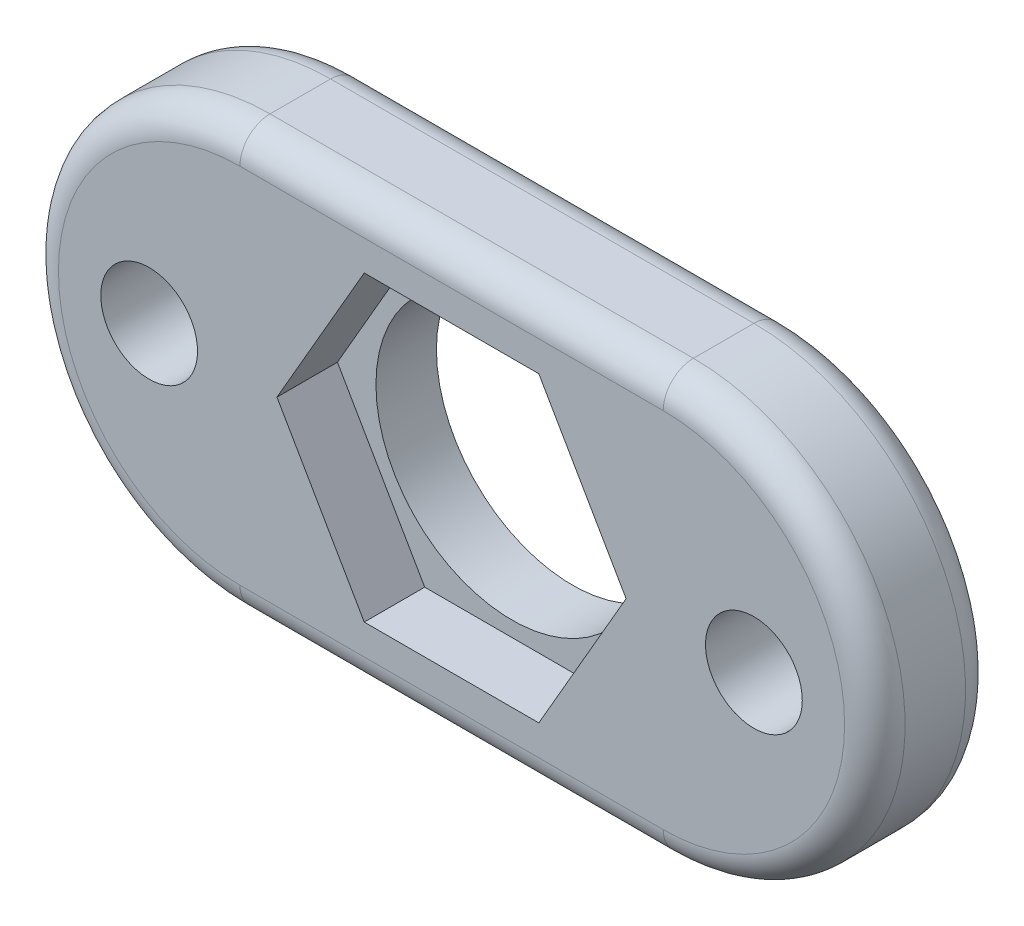
ISO-10303-21;
HEADER;
FILE_DESCRIPTION(('STEP AP214'),'2;1');
FILE_NAME('part.step','',(''),(''),'','','');
FILE_SCHEMA(('AUTOMOTIVE_DESIGN { 1 0 10303 214 1 1 1 1 }'));
ENDSEC;
DATA;
#1=APPLICATION_CONTEXT('core data for automotive mechanical design processes');
#2=APPLICATION_PROTOCOL_DEFINITION('international standard','automotive_design',2000,#1);
#3=PRODUCT_CONTEXT('',#1,'mechanical');
#4=PRODUCT('Part','Part','',(#3));
#5=PRODUCT_RELATED_PRODUCT_CATEGORY('part','',(#4));
#6=PRODUCT_DEFINITION_FORMATION('','',#4);
#7=PRODUCT_DEFINITION_CONTEXT('part definition',#1,'design');
#8=PRODUCT_DEFINITION('design','',#6,#7);
#9=PRODUCT_DEFINITION_SHAPE('','',#8);
#10=(LENGTH_UNIT() NAMED_UNIT(*) SI_UNIT(.MILLI.,.METRE.));
#11=(NAMED_UNIT(*) PLANE_ANGLE_UNIT() SI_UNIT($,.RADIAN.));
#12=(NAMED_UNIT(*) SI_UNIT($,.STERADIAN.) SOLID_ANGLE_UNIT());
#13=UNCERTAINTY_MEASURE_WITH_UNIT(LENGTH_MEASURE(1.E-05),#10,'distance_accuracy_value','');
#14=(GEOMETRIC_REPRESENTATION_CONTEXT(3) GLOBAL_UNCERTAINTY_ASSIGNED_CONTEXT((#13)) GLOBAL_UNIT_ASSIGNED_CONTEXT((#10,
#11,#12)) REPRESENTATION_CONTEXT('',''));
#15=CARTESIAN_POINT('',(0.,0.,0.));
#16=DIRECTION('',(0.,0.,1.));
#17=DIRECTION('',(1.,0.,0.));
#18=AXIS2_PLACEMENT_3D('',#15,#16,#17);
#19=CARTESIAN_POINT('',(-20.2541785109983,0.,0.));
#20=DIRECTION('',(0.,0.,1.));
#21=DIRECTION('',(1.,0.,0.));
#22=AXIS2_PLACEMENT_3D('',#19,#20,#21);
#23=CYLINDRICAL_SURFACE('',#22,4.5);
#24=CARTESIAN_POINT('',(-20.2541785109983,0.,0.));
#25=DIRECTION('',(0.,0.,1.));
#26=DIRECTION('',(1.,0.,0.));
#27=AXIS2_PLACEMENT_3D('',#24,#25,#26);
#28=CIRCLE('',#27,4.5);
#29=CARTESIAN_POINT('',(-15.7541785109983,0.,0.));
#30=VERTEX_POINT('',#29);
#31=EDGE_CURVE('E208',#30,#30,#28,.T.);
#32=ORIENTED_EDGE('',*,*,#31,.F.);
#33=EDGE_LOOP('',(#32));
#34=FACE_BOUND('',#33,.T.);
#35=CARTESIAN_POINT('',(-20.2541785109983,0.,2.));
#36=DIRECTION('',(0.,0.,1.));
#37=DIRECTION('',(1.,0.,0.));
#38=AXIS2_PLACEMENT_3D('',#35,#36,#37);
#39=CIRCLE('',#38,4.5);
#40=CARTESIAN_POINT('',(-15.7541785109983,0.,2.));
#41=VERTEX_POINT('',#40);
#42=EDGE_CURVE('E190',#41,#41,#39,.F.);
#43=ORIENTED_EDGE('',*,*,#42,.F.);
#44=EDGE_LOOP('',(#43));
#45=FACE_BOUND('',#44,.T.);
#46=ADVANCED_FACE('F33',(#34,#45),#23,.F.);
#47=CARTESIAN_POINT('',(-27.2541785109983,0.,4.));
#48=DIRECTION('',(0.,0.,-1.));
#49=DIRECTION('',(-1.,0.,0.));
#50=AXIS2_PLACEMENT_3D('',#47,#48,#49);
#51=CYLINDRICAL_SURFACE('',#50,7.);
#52=DIRECTION('',(0.,0.,-1.));
#53=VECTOR('',#52,1.);
#54=CARTESIAN_POINT('',(-27.2541785109983,-7.,4.));
#55=LINE('',#54,#53);
#56=CARTESIAN_POINT('',(-27.2541785109983,-7.,3.));
#57=VERTEX_POINT('',#56);
#58=CARTESIAN_POINT('',(-27.2541785109983,-7.,1.));
#59=VERTEX_POINT('',#58);
#60=EDGE_CURVE('E222',#57,#59,#55,.T.);
#61=ORIENTED_EDGE('',*,*,#60,.F.);
#62=CARTESIAN_POINT('',(-27.2541785109983,0.,3.));
#63=DIRECTION('',(0.,0.,1.));
#64=DIRECTION('',(1.,0.,0.));
#65=AXIS2_PLACEMENT_3D('',#62,#63,#64);
#66=CIRCLE('',#65,7.);
#67=CARTESIAN_POINT('',(-27.2541785109983,7.,3.));
#68=VERTEX_POINT('',#67);
#69=EDGE_CURVE('E11',#57,#68,#66,.F.);
#70=ORIENTED_EDGE('',*,*,#69,.T.);
#71=DIRECTION('',(0.,0.,-1.));
#72=VECTOR('',#71,1.);
#73=CARTESIAN_POINT('',(-27.2541785109983,7.,4.));
#74=LINE('',#73,#72);
#75=CARTESIAN_POINT('',(-27.2541785109983,7.,1.));
#76=VERTEX_POINT('',#75);
#77=EDGE_CURVE('E213',#68,#76,#74,.T.);
#78=ORIENTED_EDGE('',*,*,#77,.T.);
#79=CARTESIAN_POINT('',(-27.2541785109983,0.,1.));
#80=DIRECTION('',(0.,0.,1.));
#81=DIRECTION('',(1.,0.,0.));
#82=AXIS2_PLACEMENT_3D('',#79,#80,#81);
#83=CIRCLE('',#82,7.);
#84=EDGE_CURVE('E42',#76,#59,#83,.T.);
#85=ORIENTED_EDGE('',*,*,#84,.T.);
#86=EDGE_LOOP('',(#61,#70,#78,#85));
#87=FACE_BOUND('',#86,.T.);
#88=ADVANCED_FACE('F294',(#87),#51,.T.);
#89=CARTESIAN_POINT('',(-27.2541785109983,-7.,4.));
#90=DIRECTION('',(0.,1.,0.));
#91=DIRECTION('',(0.,0.,1.));
#92=AXIS2_PLACEMENT_3D('',#89,#90,#91);
#93=PLANE('',#92);
#94=DIRECTION('',(0.,0.,-1.));
#95=VECTOR('',#94,1.);
#96=CARTESIAN_POINT('',(-13.2541785109983,-7.,4.));
#97=LINE('',#96,#95);
#98=CARTESIAN_POINT('',(-13.2541785109983,-7.,3.));
#99=VERTEX_POINT('',#98);
#100=CARTESIAN_POINT('',(-13.2541785109983,-7.,1.));
#101=VERTEX_POINT('',#100);
#102=EDGE_CURVE('E219',#99,#101,#97,.T.);
#103=ORIENTED_EDGE('',*,*,#102,.F.);
#104=DIRECTION('',(1.,0.,0.));
#105=VECTOR('',#104,1.);
#106=CARTESIAN_POINT('',(-27.2541785109983,-7.,3.));
#107=LINE('',#106,#105);
#108=EDGE_CURVE('E248',#99,#57,#107,.F.);
#109=ORIENTED_EDGE('',*,*,#108,.T.);
#110=ORIENTED_EDGE('',*,*,#60,.T.);
#111=DIRECTION('',(1.,0.,0.));
#112=VECTOR('',#111,1.);
#113=CARTESIAN_POINT('',(-27.2541785109983,-7.,1.));
#114=LINE('',#113,#112);
#115=EDGE_CURVE('E246',#59,#101,#114,.T.);
#116=ORIENTED_EDGE('',*,*,#115,.T.);
#117=EDGE_LOOP('',(#103,#109,#110,#116));
#118=FACE_BOUND('',#117,.T.);
#119=ADVANCED_FACE('F311',(#118),#93,.F.);
#120=CARTESIAN_POINT('',(-13.2541785109983,0.,4.));
#121=DIRECTION('',(0.,0.,-1.));
#122=DIRECTION('',(-1.,0.,0.));
#123=AXIS2_PLACEMENT_3D('',#120,#121,#122);
#124=CYLINDRICAL_SURFACE('',#123,7.);
#125=DIRECTION('',(0.,0.,-1.));
#126=VECTOR('',#125,1.);
#127=CARTESIAN_POINT('',(-13.2541785109983,7.,4.));
#128=LINE('',#127,#126);
#129=CARTESIAN_POINT('',(-13.2541785109983,7.,3.));
#130=VERTEX_POINT('',#129);
#131=CARTESIAN_POINT('',(-13.2541785109983,7.,1.));
#132=VERTEX_POINT('',#131);
#133=EDGE_CURVE('E216',#130,#132,#128,.T.);
#134=ORIENTED_EDGE('',*,*,#133,.F.);
#135=CARTESIAN_POINT('',(-13.2541785109983,0.,3.));
#136=DIRECTION('',(0.,0.,1.));
#137=DIRECTION('',(1.,0.,0.));
#138=AXIS2_PLACEMENT_3D('',#135,#136,#137);
#139=CIRCLE('',#138,7.);
#140=EDGE_CURVE('E244',#130,#99,#139,.F.);
#141=ORIENTED_EDGE('',*,*,#140,.T.);
#142=ORIENTED_EDGE('',*,*,#102,.T.);
#143=CARTESIAN_POINT('',(-13.2541785109983,0.,1.));
#144=DIRECTION('',(0.,0.,1.));
#145=DIRECTION('',(1.,0.,0.));
#146=AXIS2_PLACEMENT_3D('',#143,#144,#145);
#147=CIRCLE('',#146,7.);
#148=EDGE_CURVE('E242',#101,#132,#147,.T.);
#149=ORIENTED_EDGE('',*,*,#148,.T.);
#150=EDGE_LOOP('',(#134,#141,#142,#149));
#151=FACE_BOUND('',#150,.T.);
#152=ADVANCED_FACE('F307',(#151),#124,.T.);
#153=CARTESIAN_POINT('',(-27.2541785109983,7.,4.));
#154=DIRECTION('',(0.,-1.,0.));
#155=DIRECTION('',(0.,0.,-1.));
#156=AXIS2_PLACEMENT_3D('',#153,#154,#155);
#157=PLANE('',#156);
#158=ORIENTED_EDGE('',*,*,#77,.F.);
#159=DIRECTION('',(-1.,0.,0.));
#160=VECTOR('',#159,1.);
#161=CARTESIAN_POINT('',(-13.2541785109983,7.,3.));
#162=LINE('',#161,#160);
#163=EDGE_CURVE('E239',#68,#130,#162,.F.);
#164=ORIENTED_EDGE('',*,*,#163,.T.);
#165=ORIENTED_EDGE('',*,*,#133,.T.);
#166=DIRECTION('',(-1.,0.,0.));
#167=VECTOR('',#166,1.);
#168=CARTESIAN_POINT('',(-27.2541785109983,7.,1.));
#169=LINE('',#168,#167);
#170=EDGE_CURVE('E236',#132,#76,#169,.T.);
#171=ORIENTED_EDGE('',*,*,#170,.T.);
#172=EDGE_LOOP('',(#158,#164,#165,#171));
#173=FACE_BOUND('',#172,.T.);
#174=ADVANCED_FACE('F291',(#173),#157,.F.);
#175=CARTESIAN_POINT('',(-27.2541785109983,0.,4.));
#176=DIRECTION('',(0.,0.,1.));
#177=DIRECTION('',(1.,0.,0.));
#178=AXIS2_PLACEMENT_3D('',#175,#176,#177);
#179=PLANE('',#178);
#180=CARTESIAN_POINT('',(-13.2541785109983,0.,4.));
#181=DIRECTION('',(0.,0.,1.));
#182=DIRECTION('',(1.,0.,0.));
#183=AXIS2_PLACEMENT_3D('',#180,#181,#182);
#184=CIRCLE('',#183,6.);
#185=CARTESIAN_POINT('',(-13.2541785109983,-6.,4.));
#186=VERTEX_POINT('',#185);
#187=CARTESIAN_POINT('',(-13.2541785109983,6.,4.));
#188=VERTEX_POINT('',#187);
#189=EDGE_CURVE('E231',#186,#188,#184,.T.);
#190=ORIENTED_EDGE('',*,*,#189,.T.);
#191=DIRECTION('',(-1.,0.,0.));
#192=VECTOR('',#191,1.);
#193=CARTESIAN_POINT('',(-27.2541785109983,6.,4.));
#194=LINE('',#193,#192);
#195=CARTESIAN_POINT('',(-27.2541785109983,6.,4.));
#196=VERTEX_POINT('',#195);
#197=EDGE_CURVE('E233',#188,#196,#194,.T.);
#198=ORIENTED_EDGE('',*,*,#197,.T.);
#199=CARTESIAN_POINT('',(-27.2541785109983,0.,4.));
#200=DIRECTION('',(0.,0.,1.));
#201=DIRECTION('',(1.,0.,0.));
#202=AXIS2_PLACEMENT_3D('',#199,#200,#201);
#203=CIRCLE('',#202,6.);
#204=CARTESIAN_POINT('',(-27.2541785109983,-6.,4.));
#205=VERTEX_POINT('',#204);
#206=EDGE_CURVE('E225',#196,#205,#203,.T.);
#207=ORIENTED_EDGE('',*,*,#206,.T.);
#208=DIRECTION('',(1.,0.,0.));
#209=VECTOR('',#208,1.);
#210=CARTESIAN_POINT('',(-13.2541785109983,-6.,4.));
#211=LINE('',#210,#209);
#212=EDGE_CURVE('E229',#205,#186,#211,.T.);
#213=ORIENTED_EDGE('',*,*,#212,.T.);
#214=EDGE_LOOP('',(#190,#198,#207,#213));
#215=FACE_BOUND('',#214,.T.);
#216=DIRECTION('',(-1.,0.,0.));
#217=VECTOR('',#216,1.);
#218=CARTESIAN_POINT('',(-17.3674271650502,5.,4.));
#219=LINE('',#218,#217);
#220=CARTESIAN_POINT('',(-17.3674271650502,5.,4.));
#221=VERTEX_POINT('',#220);
#222=CARTESIAN_POINT('',(-23.1409298569464,5.,4.));
#223=VERTEX_POINT('',#222);
#224=EDGE_CURVE('E144',#221,#223,#219,.T.);
#225=ORIENTED_EDGE('',*,*,#224,.F.);
#226=DIRECTION('',(-0.5,0.866025403784439,0.));
#227=VECTOR('',#226,1.);
#228=CARTESIAN_POINT('',(-14.4806758191021,0.,4.));
#229=LINE('',#228,#227);
#230=CARTESIAN_POINT('',(-14.4806758191021,0.,4.));
#231=VERTEX_POINT('',#230);
#232=EDGE_CURVE('E163',#231,#221,#229,.T.);
#233=ORIENTED_EDGE('',*,*,#232,.F.);
#234=DIRECTION('',(0.5,0.866025403784438,0.));
#235=VECTOR('',#234,1.);
#236=CARTESIAN_POINT('',(-17.3674271650502,-4.99999999999999,4.));
#237=LINE('',#236,#235);
#238=CARTESIAN_POINT('',(-17.3674271650502,-4.99999999999999,4.));
#239=VERTEX_POINT('',#238);
#240=EDGE_CURVE('E166',#239,#231,#237,.T.);
#241=ORIENTED_EDGE('',*,*,#240,.F.);
#242=DIRECTION('',(1.,0.,0.));
#243=VECTOR('',#242,1.);
#244=CARTESIAN_POINT('',(-23.1409298569464,-5.,4.));
#245=LINE('',#244,#243);
#246=CARTESIAN_POINT('',(-23.1409298569464,-5.,4.));
#247=VERTEX_POINT('',#246);
#248=EDGE_CURVE('E183',#247,#239,#245,.T.);
#249=ORIENTED_EDGE('',*,*,#248,.F.);
#250=DIRECTION('',(0.500000000000001,-0.866025403784438,0.));
#251=VECTOR('',#250,1.);
#252=CARTESIAN_POINT('',(-26.0276812028946,0.,4.));
#253=LINE('',#252,#251);
#254=CARTESIAN_POINT('',(-26.0276812028946,0.,4.));
#255=VERTEX_POINT('',#254);
#256=EDGE_CURVE('E180',#255,#247,#253,.T.);
#257=ORIENTED_EDGE('',*,*,#256,.F.);
#258=DIRECTION('',(-0.5,-0.866025403784438,0.));
#259=VECTOR('',#258,1.);
#260=CARTESIAN_POINT('',(-23.1409298569464,5.,4.));
#261=LINE('',#260,#259);
#262=EDGE_CURVE('E177',#223,#255,#261,.T.);
#263=ORIENTED_EDGE('',*,*,#262,.F.);
#264=EDGE_LOOP('',(#225,#233,#241,#249,#257,#263));
#265=FACE_BOUND('',#264,.T.);
#266=CARTESIAN_POINT('',(-10.2541785109983,0.,4.));
#267=DIRECTION('',(0.,0.,1.));
#268=DIRECTION('',(1.,0.,0.));
#269=AXIS2_PLACEMENT_3D('',#266,#267,#268);
#270=CIRCLE('',#269,1.6);
#271=CARTESIAN_POINT('',(-8.65417851099832,0.,4.));
#272=VERTEX_POINT('',#271);
#273=EDGE_CURVE('E202',#272,#272,#270,.T.);
#274=ORIENTED_EDGE('',*,*,#273,.F.);
#275=EDGE_LOOP('',(#274));
#276=FACE_BOUND('',#275,.T.);
#277=CARTESIAN_POINT('',(-30.2541785109983,0.,4.));
#278=DIRECTION('',(0.,0.,1.));
#279=DIRECTION('',(1.,0.,0.));
#280=AXIS2_PLACEMENT_3D('',#277,#278,#279);
#281=CIRCLE('',#280,1.60000000000001);
#282=CARTESIAN_POINT('',(-28.6541785109983,0.,4.));
#283=VERTEX_POINT('',#282);
#284=EDGE_CURVE('E201',#283,#283,#281,.T.);
#285=ORIENTED_EDGE('',*,*,#284,.F.);
#286=EDGE_LOOP('',(#285));
#287=FACE_BOUND('',#286,.T.);
#288=ADVANCED_FACE('F320',(#215,#265,#276,#287),#179,.T.);
#289=CARTESIAN_POINT('',(-27.2541785109983,0.,0.));
#290=DIRECTION('',(0.,0.,1.));
#291=DIRECTION('',(1.,0.,0.));
#292=AXIS2_PLACEMENT_3D('',#289,#290,#291);
#293=PLANE('',#292);
#294=CARTESIAN_POINT('',(-27.2541785109983,0.,0.));
#295=DIRECTION('',(0.,0.,1.));
#296=DIRECTION('',(1.,0.,0.));
#297=AXIS2_PLACEMENT_3D('',#294,#295,#296);
#298=CIRCLE('',#297,6.);
#299=CARTESIAN_POINT('',(-27.2541785109983,-6.,0.));
#300=VERTEX_POINT('',#299);
#301=CARTESIAN_POINT('',(-27.2541785109983,6.,0.));
#302=VERTEX_POINT('',#301);
#303=EDGE_CURVE('E250',#300,#302,#298,.F.);
#304=ORIENTED_EDGE('',*,*,#303,.T.);
#305=DIRECTION('',(-1.,0.,0.));
#306=VECTOR('',#305,1.);
#307=CARTESIAN_POINT('',(-27.2541785109983,6.,0.));
#308=LINE('',#307,#306);
#309=CARTESIAN_POINT('',(-13.2541785109983,6.,0.));
#310=VERTEX_POINT('',#309);
#311=EDGE_CURVE('E255',#302,#310,#308,.F.);
#312=ORIENTED_EDGE('',*,*,#311,.T.);
#313=CARTESIAN_POINT('',(-13.2541785109983,0.,0.));
#314=DIRECTION('',(0.,0.,1.));
#315=DIRECTION('',(1.,0.,0.));
#316=AXIS2_PLACEMENT_3D('',#313,#314,#315);
#317=CIRCLE('',#316,6.);
#318=CARTESIAN_POINT('',(-13.2541785109983,-6.,0.));
#319=VERTEX_POINT('',#318);
#320=EDGE_CURVE('E57',#310,#319,#317,.F.);
#321=ORIENTED_EDGE('',*,*,#320,.T.);
#322=DIRECTION('',(1.,0.,0.));
#323=VECTOR('',#322,1.);
#324=CARTESIAN_POINT('',(-27.2541785109983,-6.,0.));
#325=LINE('',#324,#323);
#326=EDGE_CURVE('E252',#319,#300,#325,.F.);
#327=ORIENTED_EDGE('',*,*,#326,.T.);
#328=EDGE_LOOP('',(#304,#312,#321,#327));
#329=FACE_BOUND('',#328,.T.);
#330=CARTESIAN_POINT('',(-10.2541785109983,0.,0.));
#331=DIRECTION('',(0.,0.,1.));
#332=DIRECTION('',(1.,0.,0.));
#333=AXIS2_PLACEMENT_3D('',#330,#331,#332);
#334=CIRCLE('',#333,1.6);
#335=CARTESIAN_POINT('',(-8.65417851099832,0.,0.));
#336=VERTEX_POINT('',#335);
#337=EDGE_CURVE('E198',#336,#336,#334,.T.);
#338=ORIENTED_EDGE('',*,*,#337,.T.);
#339=EDGE_LOOP('',(#338));
#340=FACE_BOUND('',#339,.T.);
#341=CARTESIAN_POINT('',(-30.2541785109983,0.,0.));
#342=DIRECTION('',(0.,0.,1.));
#343=DIRECTION('',(1.,0.,0.));
#344=AXIS2_PLACEMENT_3D('',#341,#342,#343);
#345=CIRCLE('',#344,1.60000000000001);
#346=CARTESIAN_POINT('',(-28.6541785109983,0.,0.));
#347=VERTEX_POINT('',#346);
#348=EDGE_CURVE('E205',#347,#347,#345,.T.);
#349=ORIENTED_EDGE('',*,*,#348,.T.);
#350=EDGE_LOOP('',(#349));
#351=FACE_BOUND('',#350,.T.);
#352=ORIENTED_EDGE('',*,*,#31,.T.);
#353=EDGE_LOOP('',(#352));
#354=FACE_BOUND('',#353,.T.);
#355=ADVANCED_FACE('F282',(#329,#340,#351,#354),#293,.F.);
#356=CARTESIAN_POINT('',(-30.2541785109983,0.,0.));
#357=DIRECTION('',(0.,0.,1.));
#358=DIRECTION('',(1.,0.,0.));
#359=AXIS2_PLACEMENT_3D('',#356,#357,#358);
#360=CYLINDRICAL_SURFACE('',#359,1.60000000000001);
#361=ORIENTED_EDGE('',*,*,#348,.F.);
#362=EDGE_LOOP('',(#361));
#363=FACE_BOUND('',#362,.T.);
#364=ORIENTED_EDGE('',*,*,#284,.T.);
#365=EDGE_LOOP('',(#364));
#366=FACE_BOUND('',#365,.T.);
#367=ADVANCED_FACE('F330',(#363,#366),#360,.F.);
#368=CARTESIAN_POINT('',(-10.2541785109983,0.,0.));
#369=DIRECTION('',(0.,0.,1.));
#370=DIRECTION('',(1.,0.,0.));
#371=AXIS2_PLACEMENT_3D('',#368,#369,#370);
#372=CYLINDRICAL_SURFACE('',#371,1.6);
#373=ORIENTED_EDGE('',*,*,#337,.F.);
#374=EDGE_LOOP('',(#373));
#375=FACE_BOUND('',#374,.T.);
#376=ORIENTED_EDGE('',*,*,#273,.T.);
#377=EDGE_LOOP('',(#376));
#378=FACE_BOUND('',#377,.T.);
#379=ADVANCED_FACE('F332',(#375,#378),#372,.F.);
#380=CARTESIAN_POINT('',(0.,0.,2.));
#381=DIRECTION('',(0.,0.,1.));
#382=DIRECTION('',(1.,0.,0.));
#383=AXIS2_PLACEMENT_3D('',#380,#381,#382);
#384=PLANE('',#383);
#385=DIRECTION('',(-1.,0.,0.));
#386=VECTOR('',#385,1.);
#387=CARTESIAN_POINT('',(-17.3674271650502,5.,2.));
#388=LINE('',#387,#386);
#389=CARTESIAN_POINT('',(-17.3674271650502,5.,2.));
#390=VERTEX_POINT('',#389);
#391=CARTESIAN_POINT('',(-23.1409298569464,5.,2.));
#392=VERTEX_POINT('',#391);
#393=EDGE_CURVE('E141',#390,#392,#388,.T.);
#394=ORIENTED_EDGE('',*,*,#393,.T.);
#395=DIRECTION('',(-0.5,-0.866025403784438,0.));
#396=VECTOR('',#395,1.);
#397=CARTESIAN_POINT('',(-23.1409298569464,5.,2.));
#398=LINE('',#397,#396);
#399=CARTESIAN_POINT('',(-26.0276812028946,0.,2.));
#400=VERTEX_POINT('',#399);
#401=EDGE_CURVE('E152',#392,#400,#398,.T.);
#402=ORIENTED_EDGE('',*,*,#401,.T.);
#403=DIRECTION('',(0.500000000000001,-0.866025403784438,0.));
#404=VECTOR('',#403,1.);
#405=CARTESIAN_POINT('',(-26.0276812028946,0.,2.));
#406=LINE('',#405,#404);
#407=CARTESIAN_POINT('',(-23.1409298569464,-5.,2.));
#408=VERTEX_POINT('',#407);
#409=EDGE_CURVE('E157',#400,#408,#406,.T.);
#410=ORIENTED_EDGE('',*,*,#409,.T.);
#411=DIRECTION('',(1.,0.,0.));
#412=VECTOR('',#411,1.);
#413=CARTESIAN_POINT('',(-23.1409298569464,-5.,2.));
#414=LINE('',#413,#412);
#415=CARTESIAN_POINT('',(-17.3674271650502,-4.99999999999999,2.));
#416=VERTEX_POINT('',#415);
#417=EDGE_CURVE('E170',#408,#416,#414,.T.);
#418=ORIENTED_EDGE('',*,*,#417,.T.);
#419=DIRECTION('',(0.5,0.866025403784438,0.));
#420=VECTOR('',#419,1.);
#421=CARTESIAN_POINT('',(-17.3674271650502,-4.99999999999999,2.));
#422=LINE('',#421,#420);
#423=CARTESIAN_POINT('',(-14.4806758191021,0.,2.));
#424=VERTEX_POINT('',#423);
#425=EDGE_CURVE('E173',#416,#424,#422,.T.);
#426=ORIENTED_EDGE('',*,*,#425,.T.);
#427=DIRECTION('',(-0.5,0.866025403784439,0.));
#428=VECTOR('',#427,1.);
#429=CARTESIAN_POINT('',(-14.4806758191021,0.,2.));
#430=LINE('',#429,#428);
#431=EDGE_CURVE('E149',#424,#390,#430,.T.);
#432=ORIENTED_EDGE('',*,*,#431,.T.);
#433=EDGE_LOOP('',(#394,#402,#410,#418,#426,#432));
#434=FACE_BOUND('',#433,.T.);
#435=ORIENTED_EDGE('',*,*,#42,.T.);
#436=EDGE_LOOP('',(#435));
#437=FACE_BOUND('',#436,.T.);
#438=ADVANCED_FACE('F159',(#434,#437),#384,.T.);
#439=CARTESIAN_POINT('',(-17.3674271650502,5.,2.));
#440=DIRECTION('',(0.,1.,0.));
#441=DIRECTION('',(-1.,0.,0.));
#442=AXIS2_PLACEMENT_3D('',#439,#440,#441);
#443=PLANE('',#442);
#444=ORIENTED_EDGE('',*,*,#224,.T.);
#445=DIRECTION('',(0.,0.,1.));
#446=VECTOR('',#445,1.);
#447=CARTESIAN_POINT('',(-23.1409298569464,5.,2.));
#448=LINE('',#447,#446);
#449=EDGE_CURVE('E137',#392,#223,#448,.T.);
#450=ORIENTED_EDGE('',*,*,#449,.F.);
#451=ORIENTED_EDGE('',*,*,#393,.F.);
#452=DIRECTION('',(0.,0.,1.));
#453=VECTOR('',#452,1.);
#454=CARTESIAN_POINT('',(-17.3674271650502,5.,2.));
#455=LINE('',#454,#453);
#456=EDGE_CURVE('E188',#390,#221,#455,.T.);
#457=ORIENTED_EDGE('',*,*,#456,.T.);
#458=EDGE_LOOP('',(#444,#450,#451,#457));
#459=FACE_BOUND('',#458,.T.);
#460=ADVANCED_FACE('F139',(#459),#443,.F.);
#461=CARTESIAN_POINT('',(-14.4806758191021,0.,2.));
#462=DIRECTION('',(0.866025403784439,0.5,0.));
#463=DIRECTION('',(-0.5,0.866025403784439,0.));
#464=AXIS2_PLACEMENT_3D('',#461,#462,#463);
#465=PLANE('',#464);
#466=ORIENTED_EDGE('',*,*,#232,.T.);
#467=ORIENTED_EDGE('',*,*,#456,.F.);
#468=ORIENTED_EDGE('',*,*,#431,.F.);
#469=DIRECTION('',(0.,0.,1.));
#470=VECTOR('',#469,1.);
#471=CARTESIAN_POINT('',(-14.4806758191021,0.,2.));
#472=LINE('',#471,#470);
#473=EDGE_CURVE('E191',#424,#231,#472,.T.);
#474=ORIENTED_EDGE('',*,*,#473,.T.);
#475=EDGE_LOOP('',(#466,#467,#468,#474));
#476=FACE_BOUND('',#475,.T.);
#477=ADVANCED_FACE('F423',(#476),#465,.F.);
#478=CARTESIAN_POINT('',(-17.3674271650502,-4.99999999999999,2.));
#479=DIRECTION('',(0.866025403784438,-0.5,0.));
#480=DIRECTION('',(0.5,0.866025403784438,0.));
#481=AXIS2_PLACEMENT_3D('',#478,#479,#480);
#482=PLANE('',#481);
#483=ORIENTED_EDGE('',*,*,#240,.T.);
#484=ORIENTED_EDGE('',*,*,#473,.F.);
#485=ORIENTED_EDGE('',*,*,#425,.F.);
#486=DIRECTION('',(0.,0.,1.));
#487=VECTOR('',#486,1.);
#488=CARTESIAN_POINT('',(-17.3674271650502,-4.99999999999999,2.));
#489=LINE('',#488,#487);
#490=EDGE_CURVE('E193',#416,#239,#489,.T.);
#491=ORIENTED_EDGE('',*,*,#490,.T.);
#492=EDGE_LOOP('',(#483,#484,#485,#491));
#493=FACE_BOUND('',#492,.T.);
#494=ADVANCED_FACE('F415',(#493),#482,.F.);
#495=CARTESIAN_POINT('',(-23.1409298569464,-5.,2.));
#496=DIRECTION('',(0.,-1.,0.));
#497=DIRECTION('',(1.,0.,0.));
#498=AXIS2_PLACEMENT_3D('',#495,#496,#497);
#499=PLANE('',#498);
#500=ORIENTED_EDGE('',*,*,#248,.T.);
#501=ORIENTED_EDGE('',*,*,#490,.F.);
#502=ORIENTED_EDGE('',*,*,#417,.F.);
#503=DIRECTION('',(0.,0.,1.));
#504=VECTOR('',#503,1.);
#505=CARTESIAN_POINT('',(-23.1409298569464,-5.,2.));
#506=LINE('',#505,#504);
#507=EDGE_CURVE('E195',#408,#247,#506,.T.);
#508=ORIENTED_EDGE('',*,*,#507,.T.);
#509=EDGE_LOOP('',(#500,#501,#502,#508));
#510=FACE_BOUND('',#509,.T.);
#511=ADVANCED_FACE('F407',(#510),#499,.F.);
#512=CARTESIAN_POINT('',(-26.0276812028946,0.,2.));
#513=DIRECTION('',(-0.866025403784438,-0.500000000000001,0.));
#514=DIRECTION('',(0.500000000000001,-0.866025403784438,0.));
#515=AXIS2_PLACEMENT_3D('',#512,#513,#514);
#516=PLANE('',#515);
#517=ORIENTED_EDGE('',*,*,#256,.T.);
#518=ORIENTED_EDGE('',*,*,#507,.F.);
#519=ORIENTED_EDGE('',*,*,#409,.F.);
#520=DIRECTION('',(0.,0.,1.));
#521=VECTOR('',#520,1.);
#522=CARTESIAN_POINT('',(-26.0276812028946,0.,2.));
#523=LINE('',#522,#521);
#524=EDGE_CURVE('E148',#400,#255,#523,.T.);
#525=ORIENTED_EDGE('',*,*,#524,.T.);
#526=EDGE_LOOP('',(#517,#518,#519,#525));
#527=FACE_BOUND('',#526,.T.);
#528=ADVANCED_FACE('F399',(#527),#516,.F.);
#529=CARTESIAN_POINT('',(-23.1409298569464,5.,2.));
#530=DIRECTION('',(-0.866025403784438,0.5,0.));
#531=DIRECTION('',(-0.5,-0.866025403784439,0.));
#532=AXIS2_PLACEMENT_3D('',#529,#530,#531);
#533=PLANE('',#532);
#534=ORIENTED_EDGE('',*,*,#262,.T.);
#535=ORIENTED_EDGE('',*,*,#524,.F.);
#536=ORIENTED_EDGE('',*,*,#401,.F.);
#537=ORIENTED_EDGE('',*,*,#449,.T.);
#538=EDGE_LOOP('',(#534,#535,#536,#537));
#539=FACE_BOUND('',#538,.T.);
#540=ADVANCED_FACE('F153',(#539),#533,.F.);
#541=CARTESIAN_POINT('',(-27.2541785109983,-6.,3.));
#542=DIRECTION('',(-1.,0.,0.));
#543=DIRECTION('',(0.,0.,1.));
#544=AXIS2_PLACEMENT_3D('',#541,#542,#543);
#545=CYLINDRICAL_SURFACE('',#544,1.);
#546=CARTESIAN_POINT('',(-27.2541785109983,-6.,3.));
#547=DIRECTION('',(-1.,0.,0.));
#548=DIRECTION('',(0.,0.,1.));
#549=AXIS2_PLACEMENT_3D('',#546,#547,#548);
#550=CIRCLE('',#549,1.);
#551=EDGE_CURVE('E262',#57,#205,#550,.T.);
#552=ORIENTED_EDGE('',*,*,#551,.F.);
#553=ORIENTED_EDGE('',*,*,#108,.F.);
#554=CARTESIAN_POINT('',(-13.2541785109983,-6.,3.));
#555=DIRECTION('',(1.,0.,0.));
#556=DIRECTION('',(0.,0.,-1.));
#557=AXIS2_PLACEMENT_3D('',#554,#555,#556);
#558=CIRCLE('',#557,1.);
#559=EDGE_CURVE('E178',#186,#99,#558,.T.);
#560=ORIENTED_EDGE('',*,*,#559,.F.);
#561=ORIENTED_EDGE('',*,*,#212,.F.);
#562=EDGE_LOOP('',(#552,#553,#560,#561));
#563=FACE_BOUND('',#562,.T.);
#564=ADVANCED_FACE('F314',(#563),#545,.T.);
#565=CARTESIAN_POINT('',(-13.2541785109983,0.,3.));
#566=DIRECTION('',(0.,0.,1.));
#567=DIRECTION('',(1.,0.,0.));
#568=AXIS2_PLACEMENT_3D('',#565,#566,#567);
#569=TOROIDAL_SURFACE('',#568,6.,1.);
#570=ORIENTED_EDGE('',*,*,#559,.T.);
#571=ORIENTED_EDGE('',*,*,#140,.F.);
#572=CARTESIAN_POINT('',(-13.2541785109983,6.,3.));
#573=DIRECTION('',(-1.,0.,0.));
#574=DIRECTION('',(0.,0.,1.));
#575=AXIS2_PLACEMENT_3D('',#572,#573,#574);
#576=CIRCLE('',#575,1.);
#577=EDGE_CURVE('E260',#188,#130,#576,.T.);
#578=ORIENTED_EDGE('',*,*,#577,.F.);
#579=ORIENTED_EDGE('',*,*,#189,.F.);
#580=EDGE_LOOP('',(#570,#571,#578,#579));
#581=FACE_BOUND('',#580,.T.);
#582=ADVANCED_FACE('F318',(#581),#569,.T.);
#583=CARTESIAN_POINT('',(-27.2541785109983,0.,3.));
#584=DIRECTION('',(0.,0.,1.));
#585=DIRECTION('',(1.,0.,0.));
#586=AXIS2_PLACEMENT_3D('',#583,#584,#585);
#587=TOROIDAL_SURFACE('',#586,6.,1.);
#588=ORIENTED_EDGE('',*,*,#551,.T.);
#589=ORIENTED_EDGE('',*,*,#206,.F.);
#590=CARTESIAN_POINT('',(-27.2541785109983,6.,3.));
#591=DIRECTION('',(1.,0.,0.));
#592=DIRECTION('',(0.,0.,-1.));
#593=AXIS2_PLACEMENT_3D('',#590,#591,#592);
#594=CIRCLE('',#593,1.);
#595=EDGE_CURVE('E258',#68,#196,#594,.T.);
#596=ORIENTED_EDGE('',*,*,#595,.F.);
#597=ORIENTED_EDGE('',*,*,#69,.F.);
#598=EDGE_LOOP('',(#588,#589,#596,#597));
#599=FACE_BOUND('',#598,.T.);
#600=ADVANCED_FACE('F299',(#599),#587,.T.);
#601=CARTESIAN_POINT('',(-27.2541785109983,6.,3.));
#602=DIRECTION('',(1.,0.,0.));
#603=DIRECTION('',(0.,0.,-1.));
#604=AXIS2_PLACEMENT_3D('',#601,#602,#603);
#605=CYLINDRICAL_SURFACE('',#604,1.);
#606=ORIENTED_EDGE('',*,*,#577,.T.);
#607=ORIENTED_EDGE('',*,*,#163,.F.);
#608=ORIENTED_EDGE('',*,*,#595,.T.);
#609=ORIENTED_EDGE('',*,*,#197,.F.);
#610=EDGE_LOOP('',(#606,#607,#608,#609));
#611=FACE_BOUND('',#610,.T.);
#612=ADVANCED_FACE('F303',(#611),#605,.T.);
#613=CARTESIAN_POINT('',(-27.2541785109983,-6.,1.));
#614=DIRECTION('',(1.,0.,0.));
#615=DIRECTION('',(0.,0.,-1.));
#616=AXIS2_PLACEMENT_3D('',#613,#614,#615);
#617=CYLINDRICAL_SURFACE('',#616,1.);
#618=CARTESIAN_POINT('',(-27.2541785109983,-6.,1.));
#619=DIRECTION('',(-1.,0.,0.));
#620=DIRECTION('',(0.,0.,1.));
#621=AXIS2_PLACEMENT_3D('',#618,#619,#620);
#622=CIRCLE('',#621,1.);
#623=EDGE_CURVE('E269',#300,#59,#622,.T.);
#624=ORIENTED_EDGE('',*,*,#623,.F.);
#625=ORIENTED_EDGE('',*,*,#326,.F.);
#626=CARTESIAN_POINT('',(-13.2541785109983,-6.,1.));
#627=DIRECTION('',(1.,0.,0.));
#628=DIRECTION('',(0.,0.,-1.));
#629=AXIS2_PLACEMENT_3D('',#626,#627,#628);
#630=CIRCLE('',#629,1.);
#631=EDGE_CURVE('E37',#101,#319,#630,.T.);
#632=ORIENTED_EDGE('',*,*,#631,.F.);
#633=ORIENTED_EDGE('',*,*,#115,.F.);
#634=EDGE_LOOP('',(#624,#625,#632,#633));
#635=FACE_BOUND('',#634,.T.);
#636=ADVANCED_FACE('F35',(#635),#617,.T.);
#637=CARTESIAN_POINT('',(-13.2541785109983,0.,1.));
#638=DIRECTION('',(0.,0.,1.));
#639=DIRECTION('',(1.,0.,0.));
#640=AXIS2_PLACEMENT_3D('',#637,#638,#639);
#641=TOROIDAL_SURFACE('',#640,6.,1.);
#642=ORIENTED_EDGE('',*,*,#631,.T.);
#643=ORIENTED_EDGE('',*,*,#320,.F.);
#644=CARTESIAN_POINT('',(-13.2541785109983,6.,1.));
#645=DIRECTION('',(-1.,0.,0.));
#646=DIRECTION('',(0.,0.,1.));
#647=AXIS2_PLACEMENT_3D('',#644,#645,#646);
#648=CIRCLE('',#647,1.);
#649=EDGE_CURVE('E50',#132,#310,#648,.T.);
#650=ORIENTED_EDGE('',*,*,#649,.F.);
#651=ORIENTED_EDGE('',*,*,#148,.F.);
#652=EDGE_LOOP('',(#642,#643,#650,#651));
#653=FACE_BOUND('',#652,.T.);
#654=ADVANCED_FACE('F279',(#653),#641,.T.);
#655=CARTESIAN_POINT('',(-27.2541785109983,0.,1.));
#656=DIRECTION('',(0.,0.,1.));
#657=DIRECTION('',(1.,0.,0.));
#658=AXIS2_PLACEMENT_3D('',#655,#656,#657);
#659=TOROIDAL_SURFACE('',#658,6.,1.);
#660=ORIENTED_EDGE('',*,*,#623,.T.);
#661=ORIENTED_EDGE('',*,*,#84,.F.);
#662=CARTESIAN_POINT('',(-27.2541785109983,6.,1.));
#663=DIRECTION('',(1.,0.,0.));
#664=DIRECTION('',(0.,0.,-1.));
#665=AXIS2_PLACEMENT_3D('',#662,#663,#664);
#666=CIRCLE('',#665,1.);
#667=EDGE_CURVE('E267',#302,#76,#666,.T.);
#668=ORIENTED_EDGE('',*,*,#667,.F.);
#669=ORIENTED_EDGE('',*,*,#303,.F.);
#670=EDGE_LOOP('',(#660,#661,#668,#669));
#671=FACE_BOUND('',#670,.T.);
#672=ADVANCED_FACE('F286',(#671),#659,.T.);
#673=CARTESIAN_POINT('',(-27.2541785109983,6.,1.));
#674=DIRECTION('',(-1.,0.,0.));
#675=DIRECTION('',(0.,0.,1.));
#676=AXIS2_PLACEMENT_3D('',#673,#674,#675);
#677=CYLINDRICAL_SURFACE('',#676,1.);
#678=ORIENTED_EDGE('',*,*,#649,.T.);
#679=ORIENTED_EDGE('',*,*,#311,.F.);
#680=ORIENTED_EDGE('',*,*,#667,.T.);
#681=ORIENTED_EDGE('',*,*,#170,.F.);
#682=EDGE_LOOP('',(#678,#679,#680,#681));
#683=FACE_BOUND('',#682,.T.);
#684=ADVANCED_FACE('F285',(#683),#677,.T.);
#685=CLOSED_SHELL('',(#46,#88,#119,#152,#174,#288,#355,#367,#379,#438,#460,#477,#494,#511,#528,
#540,#564,#582,#600,#612,#636,#654,#672,#684));
#686=MANIFOLD_SOLID_BREP('B2',#685);
#687=ADVANCED_BREP_SHAPE_REPRESENTATION('',(#18,#686),#14);
#688=SHAPE_DEFINITION_REPRESENTATION(#9,#687);
ENDSEC;
END-ISO-10303-21;
